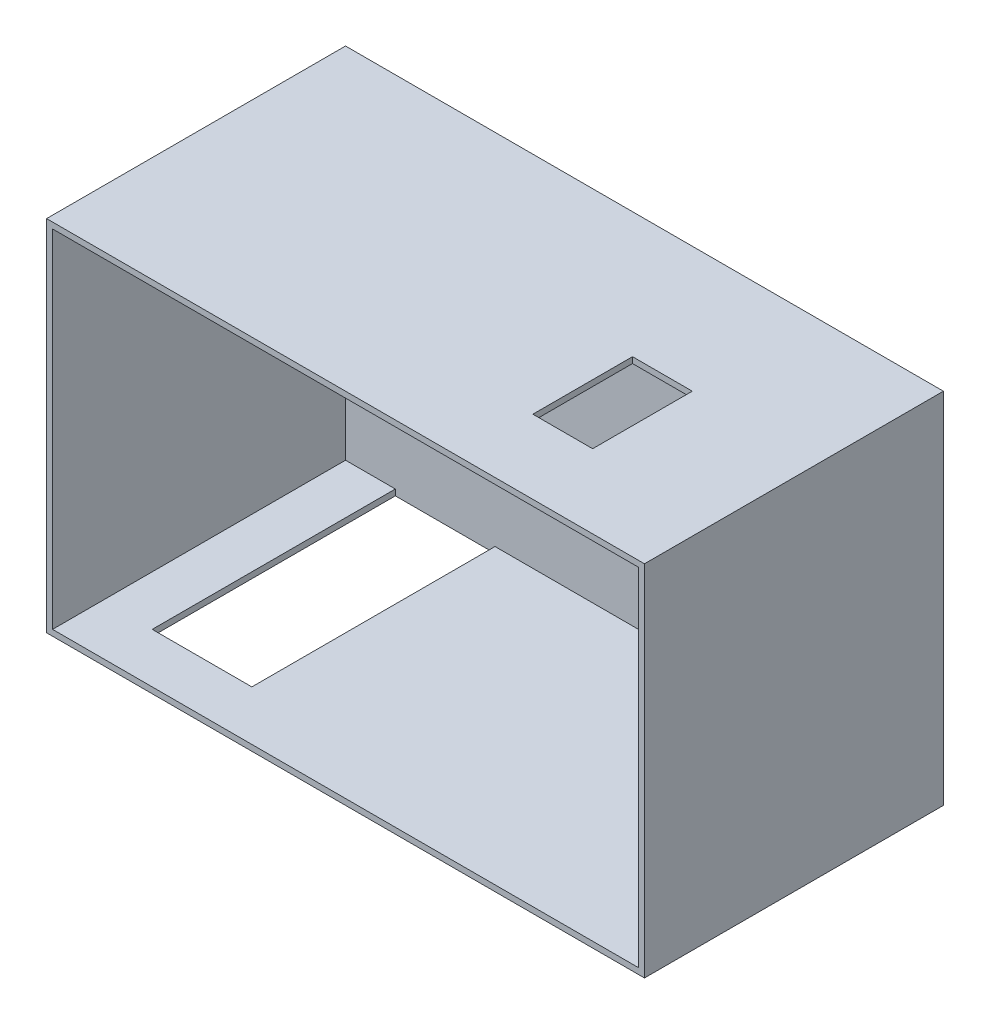
ISO-10303-21;
HEADER;
FILE_DESCRIPTION(('STEP AP214'),'2;1');
FILE_NAME('part.step','',(''),(''),'','','');
FILE_SCHEMA(('AUTOMOTIVE_DESIGN { 1 0 10303 214 1 1 1 1 }'));
ENDSEC;
DATA;
#1=APPLICATION_CONTEXT('core data for automotive mechanical design processes');
#2=APPLICATION_PROTOCOL_DEFINITION('international standard','automotive_design',2000,#1);
#3=PRODUCT_CONTEXT('',#1,'mechanical');
#4=PRODUCT('Part','Part','',(#3));
#5=PRODUCT_RELATED_PRODUCT_CATEGORY('part','',(#4));
#6=PRODUCT_DEFINITION_FORMATION('','',#4);
#7=PRODUCT_DEFINITION_CONTEXT('part definition',#1,'design');
#8=PRODUCT_DEFINITION('design','',#6,#7);
#9=PRODUCT_DEFINITION_SHAPE('','',#8);
#10=(LENGTH_UNIT() NAMED_UNIT(*) SI_UNIT(.MILLI.,.METRE.));
#11=(NAMED_UNIT(*) PLANE_ANGLE_UNIT() SI_UNIT($,.RADIAN.));
#12=(NAMED_UNIT(*) SI_UNIT($,.STERADIAN.) SOLID_ANGLE_UNIT());
#13=UNCERTAINTY_MEASURE_WITH_UNIT(LENGTH_MEASURE(1.E-05),#10,'distance_accuracy_value','');
#14=(GEOMETRIC_REPRESENTATION_CONTEXT(3) GLOBAL_UNCERTAINTY_ASSIGNED_CONTEXT((#13)) GLOBAL_UNIT_ASSIGNED_CONTEXT((#10,
#11,#12)) REPRESENTATION_CONTEXT('',''));
#15=CARTESIAN_POINT('',(0.,0.,0.));
#16=DIRECTION('',(0.,0.,1.));
#17=DIRECTION('',(1.,0.,0.));
#18=AXIS2_PLACEMENT_3D('',#15,#16,#17);
#19=CARTESIAN_POINT('',(0.,0.,150.));
#20=DIRECTION('',(-1.,0.,0.));
#21=DIRECTION('',(0.,0.,1.));
#22=AXIS2_PLACEMENT_3D('',#19,#20,#21);
#23=PLANE('',#22);
#24=DIRECTION('',(0.,1.,0.));
#25=VECTOR('',#24,1.);
#26=CARTESIAN_POINT('',(0.,0.,0.));
#27=LINE('',#26,#25);
#28=CARTESIAN_POINT('',(0.,0.,0.));
#29=VERTEX_POINT('',#28);
#30=CARTESIAN_POINT('',(0.,180.,0.));
#31=VERTEX_POINT('',#30);
#32=EDGE_CURVE('E214',#29,#31,#27,.T.);
#33=ORIENTED_EDGE('',*,*,#32,.T.);
#34=DIRECTION('',(0.,0.,-1.));
#35=VECTOR('',#34,1.);
#36=CARTESIAN_POINT('',(0.,180.,150.));
#37=LINE('',#36,#35);
#38=CARTESIAN_POINT('',(0.,180.,150.));
#39=VERTEX_POINT('',#38);
#40=EDGE_CURVE('E11',#39,#31,#37,.T.);
#41=ORIENTED_EDGE('',*,*,#40,.F.);
#42=DIRECTION('',(0.,1.,0.));
#43=VECTOR('',#42,1.);
#44=CARTESIAN_POINT('',(0.,0.,150.));
#45=LINE('',#44,#43);
#46=CARTESIAN_POINT('',(0.,0.,150.));
#47=VERTEX_POINT('',#46);
#48=EDGE_CURVE('E240',#47,#39,#45,.T.);
#49=ORIENTED_EDGE('',*,*,#48,.F.);
#50=DIRECTION('',(0.,0.,-1.));
#51=VECTOR('',#50,1.);
#52=CARTESIAN_POINT('',(0.,0.,150.));
#53=LINE('',#52,#51);
#54=EDGE_CURVE('E250',#47,#29,#53,.T.);
#55=ORIENTED_EDGE('',*,*,#54,.T.);
#56=EDGE_LOOP('',(#33,#41,#49,#55));
#57=FACE_BOUND('',#56,.T.);
#58=ADVANCED_FACE('F31',(#57),#23,.F.);
#59=CARTESIAN_POINT('',(0.,180.,150.));
#60=DIRECTION('',(0.,-1.,0.));
#61=DIRECTION('',(0.,0.,-1.));
#62=AXIS2_PLACEMENT_3D('',#59,#60,#61);
#63=PLANE('',#62);
#64=DIRECTION('',(-1.,0.,0.));
#65=VECTOR('',#64,1.);
#66=CARTESIAN_POINT('',(-63.,180.,63.));
#67=LINE('',#66,#65);
#68=CARTESIAN_POINT('',(-63.,180.,63.));
#69=VERTEX_POINT('',#68);
#70=CARTESIAN_POINT('',(-93.,180.,63.));
#71=VERTEX_POINT('',#70);
#72=EDGE_CURVE('E163',#69,#71,#67,.T.);
#73=ORIENTED_EDGE('',*,*,#72,.F.);
#74=DIRECTION('',(0.,0.,-1.));
#75=VECTOR('',#74,1.);
#76=CARTESIAN_POINT('',(-63.,180.,113.));
#77=LINE('',#76,#75);
#78=CARTESIAN_POINT('',(-63.,180.,113.));
#79=VERTEX_POINT('',#78);
#80=EDGE_CURVE('E145',#79,#69,#77,.T.);
#81=ORIENTED_EDGE('',*,*,#80,.F.);
#82=DIRECTION('',(1.,0.,0.));
#83=VECTOR('',#82,1.);
#84=CARTESIAN_POINT('',(-63.,180.,113.));
#85=LINE('',#84,#83);
#86=CARTESIAN_POINT('',(-93.,180.,113.));
#87=VERTEX_POINT('',#86);
#88=EDGE_CURVE('E154',#87,#79,#85,.T.);
#89=ORIENTED_EDGE('',*,*,#88,.F.);
#90=DIRECTION('',(0.,0.,1.));
#91=VECTOR('',#90,1.);
#92=CARTESIAN_POINT('',(-93.,180.,113.));
#93=LINE('',#92,#91);
#94=EDGE_CURVE('E45',#71,#87,#93,.T.);
#95=ORIENTED_EDGE('',*,*,#94,.F.);
#96=EDGE_LOOP('',(#73,#81,#89,#95));
#97=FACE_BOUND('',#96,.T.);
#98=DIRECTION('',(-1.,0.,0.));
#99=VECTOR('',#98,1.);
#100=CARTESIAN_POINT('',(0.,180.,0.));
#101=LINE('',#100,#99);
#102=CARTESIAN_POINT('',(-300.,180.,0.));
#103=VERTEX_POINT('',#102);
#104=EDGE_CURVE('E253',#31,#103,#101,.T.);
#105=ORIENTED_EDGE('',*,*,#104,.T.);
#106=DIRECTION('',(0.,0.,-1.));
#107=VECTOR('',#106,1.);
#108=CARTESIAN_POINT('',(-300.,180.,150.));
#109=LINE('',#108,#107);
#110=CARTESIAN_POINT('',(-300.,180.,150.));
#111=VERTEX_POINT('',#110);
#112=EDGE_CURVE('E38',#111,#103,#109,.T.);
#113=ORIENTED_EDGE('',*,*,#112,.F.);
#114=DIRECTION('',(-1.,0.,0.));
#115=VECTOR('',#114,1.);
#116=CARTESIAN_POINT('',(0.,180.,150.));
#117=LINE('',#116,#115);
#118=EDGE_CURVE('E243',#39,#111,#117,.T.);
#119=ORIENTED_EDGE('',*,*,#118,.F.);
#120=ORIENTED_EDGE('',*,*,#40,.T.);
#121=EDGE_LOOP('',(#105,#113,#119,#120));
#122=FACE_BOUND('',#121,.T.);
#123=ADVANCED_FACE('F160',(#97,#122),#63,.F.);
#124=CARTESIAN_POINT('',(-300.,0.,150.));
#125=DIRECTION('',(1.,0.,0.));
#126=DIRECTION('',(0.,0.,-1.));
#127=AXIS2_PLACEMENT_3D('',#124,#125,#126);
#128=PLANE('',#127);
#129=DIRECTION('',(0.,-1.,0.));
#130=VECTOR('',#129,1.);
#131=CARTESIAN_POINT('',(-300.,0.,0.));
#132=LINE('',#131,#130);
#133=CARTESIAN_POINT('',(-300.,0.,0.));
#134=VERTEX_POINT('',#133);
#135=EDGE_CURVE('E255',#103,#134,#132,.T.);
#136=ORIENTED_EDGE('',*,*,#135,.T.);
#137=DIRECTION('',(0.,0.,-1.));
#138=VECTOR('',#137,1.);
#139=CARTESIAN_POINT('',(-300.,0.,150.));
#140=LINE('',#139,#138);
#141=CARTESIAN_POINT('',(-300.,0.,150.));
#142=VERTEX_POINT('',#141);
#143=EDGE_CURVE('E260',#142,#134,#140,.T.);
#144=ORIENTED_EDGE('',*,*,#143,.F.);
#145=DIRECTION('',(0.,-1.,0.));
#146=VECTOR('',#145,1.);
#147=CARTESIAN_POINT('',(-300.,0.,150.));
#148=LINE('',#147,#146);
#149=EDGE_CURVE('E246',#111,#142,#148,.T.);
#150=ORIENTED_EDGE('',*,*,#149,.F.);
#151=ORIENTED_EDGE('',*,*,#112,.T.);
#152=EDGE_LOOP('',(#136,#144,#150,#151));
#153=FACE_BOUND('',#152,.T.);
#154=ADVANCED_FACE('F267',(#153),#128,.F.);
#155=CARTESIAN_POINT('',(0.,0.,150.));
#156=DIRECTION('',(0.,1.,0.));
#157=DIRECTION('',(-1.,0.,0.));
#158=AXIS2_PLACEMENT_3D('',#155,#156,#157);
#159=PLANE('',#158);
#160=DIRECTION('',(1.,0.,0.));
#161=VECTOR('',#160,1.);
#162=CARTESIAN_POINT('',(-272.,0.,3.));
#163=LINE('',#162,#161);
#164=CARTESIAN_POINT('',(-272.,0.,3.));
#165=VERTEX_POINT('',#164);
#166=CARTESIAN_POINT('',(-222.,0.,3.));
#167=VERTEX_POINT('',#166);
#168=EDGE_CURVE('E181',#165,#167,#163,.T.);
#169=ORIENTED_EDGE('',*,*,#168,.F.);
#170=DIRECTION('',(0.,0.,-1.));
#171=VECTOR('',#170,1.);
#172=CARTESIAN_POINT('',(-272.,0.,3.));
#173=LINE('',#172,#171);
#174=CARTESIAN_POINT('',(-272.,0.,125.));
#175=VERTEX_POINT('',#174);
#176=EDGE_CURVE('E184',#175,#165,#173,.T.);
#177=ORIENTED_EDGE('',*,*,#176,.F.);
#178=DIRECTION('',(-1.,0.,0.));
#179=VECTOR('',#178,1.);
#180=CARTESIAN_POINT('',(-272.,0.,125.));
#181=LINE('',#180,#179);
#182=CARTESIAN_POINT('',(-222.,0.,125.));
#183=VERTEX_POINT('',#182);
#184=EDGE_CURVE('E198',#183,#175,#181,.T.);
#185=ORIENTED_EDGE('',*,*,#184,.F.);
#186=DIRECTION('',(0.,0.,1.));
#187=VECTOR('',#186,1.);
#188=CARTESIAN_POINT('',(-222.,0.,3.));
#189=LINE('',#188,#187);
#190=EDGE_CURVE('E157',#167,#183,#189,.T.);
#191=ORIENTED_EDGE('',*,*,#190,.F.);
#192=EDGE_LOOP('',(#169,#177,#185,#191));
#193=FACE_BOUND('',#192,.T.);
#194=DIRECTION('',(1.,0.,0.));
#195=VECTOR('',#194,1.);
#196=CARTESIAN_POINT('',(0.,0.,0.));
#197=LINE('',#196,#195);
#198=EDGE_CURVE('E244',#134,#29,#197,.T.);
#199=ORIENTED_EDGE('',*,*,#198,.T.);
#200=ORIENTED_EDGE('',*,*,#54,.F.);
#201=DIRECTION('',(1.,0.,0.));
#202=VECTOR('',#201,1.);
#203=CARTESIAN_POINT('',(0.,0.,150.));
#204=LINE('',#203,#202);
#205=EDGE_CURVE('E248',#142,#47,#204,.T.);
#206=ORIENTED_EDGE('',*,*,#205,.F.);
#207=ORIENTED_EDGE('',*,*,#143,.T.);
#208=EDGE_LOOP('',(#199,#200,#206,#207));
#209=FACE_BOUND('',#208,.T.);
#210=ADVANCED_FACE('F275',(#193,#209),#159,.F.);
#211=CARTESIAN_POINT('',(0.,180.,150.));
#212=DIRECTION('',(0.,0.,1.));
#213=DIRECTION('',(1.,0.,0.));
#214=AXIS2_PLACEMENT_3D('',#211,#212,#213);
#215=PLANE('',#214);
#216=DIRECTION('',(0.,1.,0.));
#217=VECTOR('',#216,1.);
#218=CARTESIAN_POINT('',(-3.,0.,150.));
#219=LINE('',#218,#217);
#220=CARTESIAN_POINT('',(-3.,3.,150.));
#221=VERTEX_POINT('',#220);
#222=CARTESIAN_POINT('',(-3.,177.,150.));
#223=VERTEX_POINT('',#222);
#224=EDGE_CURVE('E232',#221,#223,#219,.T.);
#225=ORIENTED_EDGE('',*,*,#224,.F.);
#226=DIRECTION('',(1.,0.,0.));
#227=VECTOR('',#226,1.);
#228=CARTESIAN_POINT('',(0.,3.,150.));
#229=LINE('',#228,#227);
#230=CARTESIAN_POINT('',(-297.,2.99999999999996,150.));
#231=VERTEX_POINT('',#230);
#232=EDGE_CURVE('E220',#231,#221,#229,.T.);
#233=ORIENTED_EDGE('',*,*,#232,.F.);
#234=DIRECTION('',(0.,-1.,0.));
#235=VECTOR('',#234,1.);
#236=CARTESIAN_POINT('',(-297.,0.,150.));
#237=LINE('',#236,#235);
#238=CARTESIAN_POINT('',(-297.,177.,150.));
#239=VERTEX_POINT('',#238);
#240=EDGE_CURVE('E236',#239,#231,#237,.T.);
#241=ORIENTED_EDGE('',*,*,#240,.F.);
#242=DIRECTION('',(-1.,0.,0.));
#243=VECTOR('',#242,1.);
#244=CARTESIAN_POINT('',(0.,177.,150.));
#245=LINE('',#244,#243);
#246=EDGE_CURVE('E234',#223,#239,#245,.T.);
#247=ORIENTED_EDGE('',*,*,#246,.F.);
#248=EDGE_LOOP('',(#225,#233,#241,#247));
#249=FACE_BOUND('',#248,.T.);
#250=ORIENTED_EDGE('',*,*,#48,.T.);
#251=ORIENTED_EDGE('',*,*,#118,.T.);
#252=ORIENTED_EDGE('',*,*,#149,.T.);
#253=ORIENTED_EDGE('',*,*,#205,.T.);
#254=EDGE_LOOP('',(#250,#251,#252,#253));
#255=FACE_BOUND('',#254,.T.);
#256=ADVANCED_FACE('F281',(#249,#255),#215,.T.);
#257=CARTESIAN_POINT('',(0.,180.,0.));
#258=DIRECTION('',(0.,0.,1.));
#259=DIRECTION('',(1.,0.,0.));
#260=AXIS2_PLACEMENT_3D('',#257,#258,#259);
#261=PLANE('',#260);
#262=ORIENTED_EDGE('',*,*,#32,.F.);
#263=ORIENTED_EDGE('',*,*,#198,.F.);
#264=ORIENTED_EDGE('',*,*,#135,.F.);
#265=ORIENTED_EDGE('',*,*,#104,.F.);
#266=EDGE_LOOP('',(#262,#263,#264,#265));
#267=FACE_BOUND('',#266,.T.);
#268=ADVANCED_FACE('F272',(#267),#261,.F.);
#269=CARTESIAN_POINT('',(-3.,0.,150.));
#270=DIRECTION('',(-1.,0.,0.));
#271=DIRECTION('',(0.,0.,1.));
#272=AXIS2_PLACEMENT_3D('',#269,#270,#271);
#273=PLANE('',#272);
#274=DIRECTION('',(0.,1.,0.));
#275=VECTOR('',#274,1.);
#276=CARTESIAN_POINT('',(-3.,0.,3.));
#277=LINE('',#276,#275);
#278=CARTESIAN_POINT('',(-3.,3.,3.));
#279=VERTEX_POINT('',#278);
#280=CARTESIAN_POINT('',(-3.,177.,3.));
#281=VERTEX_POINT('',#280);
#282=EDGE_CURVE('E207',#279,#281,#277,.T.);
#283=ORIENTED_EDGE('',*,*,#282,.F.);
#284=DIRECTION('',(0.,0.,-1.));
#285=VECTOR('',#284,1.);
#286=CARTESIAN_POINT('',(-3.,3.,150.));
#287=LINE('',#286,#285);
#288=EDGE_CURVE('E216',#221,#279,#287,.T.);
#289=ORIENTED_EDGE('',*,*,#288,.F.);
#290=ORIENTED_EDGE('',*,*,#224,.T.);
#291=DIRECTION('',(0.,0.,-1.));
#292=VECTOR('',#291,1.);
#293=CARTESIAN_POINT('',(-3.,177.,150.));
#294=LINE('',#293,#292);
#295=EDGE_CURVE('E211',#223,#281,#294,.T.);
#296=ORIENTED_EDGE('',*,*,#295,.T.);
#297=EDGE_LOOP('',(#283,#289,#290,#296));
#298=FACE_BOUND('',#297,.T.);
#299=ADVANCED_FACE('F294',(#298),#273,.T.);
#300=CARTESIAN_POINT('',(0.,177.,150.));
#301=DIRECTION('',(0.,-1.,0.));
#302=DIRECTION('',(0.,0.,-1.));
#303=AXIS2_PLACEMENT_3D('',#300,#301,#302);
#304=PLANE('',#303);
#305=DIRECTION('',(0.,0.,1.));
#306=VECTOR('',#305,1.);
#307=CARTESIAN_POINT('',(-63.,177.,113.));
#308=LINE('',#307,#306);
#309=CARTESIAN_POINT('',(-63.,177.,63.));
#310=VERTEX_POINT('',#309);
#311=CARTESIAN_POINT('',(-63.,177.,113.));
#312=VERTEX_POINT('',#311);
#313=EDGE_CURVE('E53',#310,#312,#308,.T.);
#314=ORIENTED_EDGE('',*,*,#313,.F.);
#315=DIRECTION('',(1.,0.,0.));
#316=VECTOR('',#315,1.);
#317=CARTESIAN_POINT('',(-63.,177.,63.));
#318=LINE('',#317,#316);
#319=CARTESIAN_POINT('',(-93.,177.,63.));
#320=VERTEX_POINT('',#319);
#321=EDGE_CURVE('E151',#320,#310,#318,.T.);
#322=ORIENTED_EDGE('',*,*,#321,.F.);
#323=DIRECTION('',(0.,0.,-1.));
#324=VECTOR('',#323,1.);
#325=CARTESIAN_POINT('',(-93.,177.,113.));
#326=LINE('',#325,#324);
#327=CARTESIAN_POINT('',(-93.,177.,113.));
#328=VERTEX_POINT('',#327);
#329=EDGE_CURVE('E171',#328,#320,#326,.T.);
#330=ORIENTED_EDGE('',*,*,#329,.F.);
#331=DIRECTION('',(-1.,0.,0.));
#332=VECTOR('',#331,1.);
#333=CARTESIAN_POINT('',(-63.,177.,113.));
#334=LINE('',#333,#332);
#335=EDGE_CURVE('E165',#312,#328,#334,.T.);
#336=ORIENTED_EDGE('',*,*,#335,.F.);
#337=EDGE_LOOP('',(#314,#322,#330,#336));
#338=FACE_BOUND('',#337,.T.);
#339=DIRECTION('',(-1.,0.,0.));
#340=VECTOR('',#339,1.);
#341=CARTESIAN_POINT('',(0.,177.,3.));
#342=LINE('',#341,#340);
#343=CARTESIAN_POINT('',(-297.,177.,3.));
#344=VERTEX_POINT('',#343);
#345=EDGE_CURVE('E210',#281,#344,#342,.T.);
#346=ORIENTED_EDGE('',*,*,#345,.F.);
#347=ORIENTED_EDGE('',*,*,#295,.F.);
#348=ORIENTED_EDGE('',*,*,#246,.T.);
#349=DIRECTION('',(0.,0.,-1.));
#350=VECTOR('',#349,1.);
#351=CARTESIAN_POINT('',(-297.,177.,150.));
#352=LINE('',#351,#350);
#353=EDGE_CURVE('E215',#239,#344,#352,.T.);
#354=ORIENTED_EDGE('',*,*,#353,.T.);
#355=EDGE_LOOP('',(#346,#347,#348,#354));
#356=FACE_BOUND('',#355,.T.);
#357=ADVANCED_FACE('F310',(#338,#356),#304,.T.);
#358=CARTESIAN_POINT('',(-297.,0.,150.));
#359=DIRECTION('',(1.,0.,0.));
#360=DIRECTION('',(0.,0.,-1.));
#361=AXIS2_PLACEMENT_3D('',#358,#359,#360);
#362=PLANE('',#361);
#363=DIRECTION('',(0.,-1.,0.));
#364=VECTOR('',#363,1.);
#365=CARTESIAN_POINT('',(-297.,0.,3.));
#366=LINE('',#365,#364);
#367=CARTESIAN_POINT('',(-297.,2.99999999999996,3.));
#368=VERTEX_POINT('',#367);
#369=EDGE_CURVE('E222',#344,#368,#366,.T.);
#370=ORIENTED_EDGE('',*,*,#369,.F.);
#371=ORIENTED_EDGE('',*,*,#353,.F.);
#372=ORIENTED_EDGE('',*,*,#240,.T.);
#373=DIRECTION('',(0.,0.,-1.));
#374=VECTOR('',#373,1.);
#375=CARTESIAN_POINT('',(-297.,2.99999999999996,150.));
#376=LINE('',#375,#374);
#377=EDGE_CURVE('E219',#231,#368,#376,.T.);
#378=ORIENTED_EDGE('',*,*,#377,.T.);
#379=EDGE_LOOP('',(#370,#371,#372,#378));
#380=FACE_BOUND('',#379,.T.);
#381=ADVANCED_FACE('F306',(#380),#362,.T.);
#382=CARTESIAN_POINT('',(0.,3.,150.));
#383=DIRECTION('',(0.,1.,0.));
#384=DIRECTION('',(-1.,0.,0.));
#385=AXIS2_PLACEMENT_3D('',#382,#383,#384);
#386=PLANE('',#385);
#387=DIRECTION('',(0.,0.,1.));
#388=VECTOR('',#387,1.);
#389=CARTESIAN_POINT('',(-272.,2.99999999999997,3.));
#390=LINE('',#389,#388);
#391=CARTESIAN_POINT('',(-272.,2.99999999999997,3.));
#392=VERTEX_POINT('',#391);
#393=CARTESIAN_POINT('',(-272.,2.99999999999997,125.));
#394=VERTEX_POINT('',#393);
#395=EDGE_CURVE('E187',#392,#394,#390,.T.);
#396=ORIENTED_EDGE('',*,*,#395,.F.);
#397=DIRECTION('',(1.,0.,0.));
#398=VECTOR('',#397,1.);
#399=CARTESIAN_POINT('',(0.,3.,3.));
#400=LINE('',#399,#398);
#401=EDGE_CURVE('E229',#368,#392,#400,.T.);
#402=ORIENTED_EDGE('',*,*,#401,.F.);
#403=ORIENTED_EDGE('',*,*,#377,.F.);
#404=ORIENTED_EDGE('',*,*,#232,.T.);
#405=ORIENTED_EDGE('',*,*,#288,.T.);
#406=CARTESIAN_POINT('',(-222.,2.99999999999997,3.));
#407=VERTEX_POINT('',#406);
#408=EDGE_CURVE('E226',#407,#279,#400,.T.);
#409=ORIENTED_EDGE('',*,*,#408,.F.);
#410=DIRECTION('',(0.,0.,-1.));
#411=VECTOR('',#410,1.);
#412=CARTESIAN_POINT('',(-222.,2.99999999999997,3.));
#413=LINE('',#412,#411);
#414=CARTESIAN_POINT('',(-222.,2.99999999999997,125.));
#415=VERTEX_POINT('',#414);
#416=EDGE_CURVE('E193',#415,#407,#413,.T.);
#417=ORIENTED_EDGE('',*,*,#416,.F.);
#418=DIRECTION('',(1.,0.,0.));
#419=VECTOR('',#418,1.);
#420=CARTESIAN_POINT('',(-272.,2.99999999999997,125.));
#421=LINE('',#420,#419);
#422=EDGE_CURVE('E190',#394,#415,#421,.T.);
#423=ORIENTED_EDGE('',*,*,#422,.F.);
#424=EDGE_LOOP('',(#396,#402,#403,#404,#405,#409,#417,#423));
#425=FACE_BOUND('',#424,.T.);
#426=ADVANCED_FACE('F302',(#425),#386,.T.);
#427=CARTESIAN_POINT('',(0.,180.,3.));
#428=DIRECTION('',(0.,0.,1.));
#429=DIRECTION('',(1.,0.,0.));
#430=AXIS2_PLACEMENT_3D('',#427,#428,#429);
#431=PLANE('',#430);
#432=ORIENTED_EDGE('',*,*,#282,.T.);
#433=ORIENTED_EDGE('',*,*,#345,.T.);
#434=ORIENTED_EDGE('',*,*,#369,.T.);
#435=ORIENTED_EDGE('',*,*,#401,.T.);
#436=DIRECTION('',(0.,1.,0.));
#437=VECTOR('',#436,1.);
#438=CARTESIAN_POINT('',(-272.,-0.00100000000006996,3.));
#439=LINE('',#438,#437);
#440=EDGE_CURVE('E196',#165,#392,#439,.T.);
#441=ORIENTED_EDGE('',*,*,#440,.F.);
#442=ORIENTED_EDGE('',*,*,#168,.T.);
#443=DIRECTION('',(0.,1.,0.));
#444=VECTOR('',#443,1.);
#445=CARTESIAN_POINT('',(-222.,-0.00100000000006388,3.));
#446=LINE('',#445,#444);
#447=EDGE_CURVE('E199',#167,#407,#446,.T.);
#448=ORIENTED_EDGE('',*,*,#447,.T.);
#449=ORIENTED_EDGE('',*,*,#408,.T.);
#450=EDGE_LOOP('',(#432,#433,#434,#435,#441,#442,#448,#449));
#451=FACE_BOUND('',#450,.T.);
#452=ADVANCED_FACE('F298',(#451),#431,.T.);
#453=CARTESIAN_POINT('',(-272.,-0.00100000000006996,3.));
#454=DIRECTION('',(-1.,0.,0.));
#455=DIRECTION('',(0.,-1.,0.));
#456=AXIS2_PLACEMENT_3D('',#453,#454,#455);
#457=PLANE('',#456);
#458=ORIENTED_EDGE('',*,*,#176,.T.);
#459=ORIENTED_EDGE('',*,*,#440,.T.);
#460=ORIENTED_EDGE('',*,*,#395,.T.);
#461=DIRECTION('',(0.,1.,0.));
#462=VECTOR('',#461,1.);
#463=CARTESIAN_POINT('',(-272.,-0.00100000000006996,125.));
#464=LINE('',#463,#462);
#465=EDGE_CURVE('E195',#175,#394,#464,.T.);
#466=ORIENTED_EDGE('',*,*,#465,.F.);
#467=EDGE_LOOP('',(#458,#459,#460,#466));
#468=FACE_BOUND('',#467,.T.);
#469=ADVANCED_FACE('F301',(#468),#457,.F.);
#470=CARTESIAN_POINT('',(-222.,-0.00100000000006388,3.));
#471=DIRECTION('',(1.,0.,0.));
#472=DIRECTION('',(0.,1.,0.));
#473=AXIS2_PLACEMENT_3D('',#470,#471,#472);
#474=PLANE('',#473);
#475=ORIENTED_EDGE('',*,*,#190,.T.);
#476=DIRECTION('',(0.,1.,0.));
#477=VECTOR('',#476,1.);
#478=CARTESIAN_POINT('',(-222.,-0.00100000000006388,125.));
#479=LINE('',#478,#477);
#480=EDGE_CURVE('E202',#183,#415,#479,.T.);
#481=ORIENTED_EDGE('',*,*,#480,.T.);
#482=ORIENTED_EDGE('',*,*,#416,.T.);
#483=ORIENTED_EDGE('',*,*,#447,.F.);
#484=EDGE_LOOP('',(#475,#481,#482,#483));
#485=FACE_BOUND('',#484,.T.);
#486=ADVANCED_FACE('F320',(#485),#474,.F.);
#487=CARTESIAN_POINT('',(-272.,-0.00100000000006996,125.));
#488=DIRECTION('',(0.,0.,1.));
#489=DIRECTION('',(1.,0.,0.));
#490=AXIS2_PLACEMENT_3D('',#487,#488,#489);
#491=PLANE('',#490);
#492=ORIENTED_EDGE('',*,*,#184,.T.);
#493=ORIENTED_EDGE('',*,*,#465,.T.);
#494=ORIENTED_EDGE('',*,*,#422,.T.);
#495=ORIENTED_EDGE('',*,*,#480,.F.);
#496=EDGE_LOOP('',(#492,#493,#494,#495));
#497=FACE_BOUND('',#496,.T.);
#498=ADVANCED_FACE('F322',(#497),#491,.F.);
#499=CARTESIAN_POINT('',(-63.,180.001,113.));
#500=DIRECTION('',(1.,0.,0.));
#501=DIRECTION('',(0.,1.,0.));
#502=AXIS2_PLACEMENT_3D('',#499,#500,#501);
#503=PLANE('',#502);
#504=ORIENTED_EDGE('',*,*,#80,.T.);
#505=DIRECTION('',(0.,-1.,0.));
#506=VECTOR('',#505,1.);
#507=CARTESIAN_POINT('',(-63.,180.001,63.));
#508=LINE('',#507,#506);
#509=EDGE_CURVE('E158',#69,#310,#508,.T.);
#510=ORIENTED_EDGE('',*,*,#509,.T.);
#511=ORIENTED_EDGE('',*,*,#313,.T.);
#512=DIRECTION('',(0.,-1.,0.));
#513=VECTOR('',#512,1.);
#514=CARTESIAN_POINT('',(-63.,180.001,113.));
#515=LINE('',#514,#513);
#516=EDGE_CURVE('E141',#79,#312,#515,.T.);
#517=ORIENTED_EDGE('',*,*,#516,.F.);
#518=EDGE_LOOP('',(#504,#510,#511,#517));
#519=FACE_BOUND('',#518,.T.);
#520=ADVANCED_FACE('F143',(#519),#503,.F.);
#521=CARTESIAN_POINT('',(-63.,180.001,63.));
#522=DIRECTION('',(0.,0.,-1.));
#523=DIRECTION('',(-1.,0.,0.));
#524=AXIS2_PLACEMENT_3D('',#521,#522,#523);
#525=PLANE('',#524);
#526=ORIENTED_EDGE('',*,*,#72,.T.);
#527=DIRECTION('',(0.,-1.,0.));
#528=VECTOR('',#527,1.);
#529=CARTESIAN_POINT('',(-93.,180.001,63.));
#530=LINE('',#529,#528);
#531=EDGE_CURVE('E177',#71,#320,#530,.T.);
#532=ORIENTED_EDGE('',*,*,#531,.T.);
#533=ORIENTED_EDGE('',*,*,#321,.T.);
#534=ORIENTED_EDGE('',*,*,#509,.F.);
#535=EDGE_LOOP('',(#526,#532,#533,#534));
#536=FACE_BOUND('',#535,.T.);
#537=ADVANCED_FACE('F331',(#536),#525,.F.);
#538=CARTESIAN_POINT('',(-93.,180.001,113.));
#539=DIRECTION('',(-1.,0.,0.));
#540=DIRECTION('',(0.,-1.,0.));
#541=AXIS2_PLACEMENT_3D('',#538,#539,#540);
#542=PLANE('',#541);
#543=ORIENTED_EDGE('',*,*,#94,.T.);
#544=DIRECTION('',(0.,-1.,0.));
#545=VECTOR('',#544,1.);
#546=CARTESIAN_POINT('',(-93.,180.001,113.));
#547=LINE('',#546,#545);
#548=EDGE_CURVE('E150',#87,#328,#547,.T.);
#549=ORIENTED_EDGE('',*,*,#548,.T.);
#550=ORIENTED_EDGE('',*,*,#329,.T.);
#551=ORIENTED_EDGE('',*,*,#531,.F.);
#552=EDGE_LOOP('',(#543,#549,#550,#551));
#553=FACE_BOUND('',#552,.T.);
#554=ADVANCED_FACE('F334',(#553),#542,.F.);
#555=CARTESIAN_POINT('',(-63.,180.001,113.));
#556=DIRECTION('',(0.,0.,1.));
#557=DIRECTION('',(1.,0.,0.));
#558=AXIS2_PLACEMENT_3D('',#555,#556,#557);
#559=PLANE('',#558);
#560=ORIENTED_EDGE('',*,*,#88,.T.);
#561=ORIENTED_EDGE('',*,*,#516,.T.);
#562=ORIENTED_EDGE('',*,*,#335,.T.);
#563=ORIENTED_EDGE('',*,*,#548,.F.);
#564=EDGE_LOOP('',(#560,#561,#562,#563));
#565=FACE_BOUND('',#564,.T.);
#566=ADVANCED_FACE('F155',(#565),#559,.F.);
#567=CLOSED_SHELL('',(#58,#123,#154,#210,#256,#268,#299,#357,#381,#426,#452,#469,#486,#498,#520,
#537,#554,#566));
#568=MANIFOLD_SOLID_BREP('B2',#567);
#569=ADVANCED_BREP_SHAPE_REPRESENTATION('',(#18,#568),#14);
#570=SHAPE_DEFINITION_REPRESENTATION(#9,#569);
ENDSEC;
END-ISO-10303-21;
